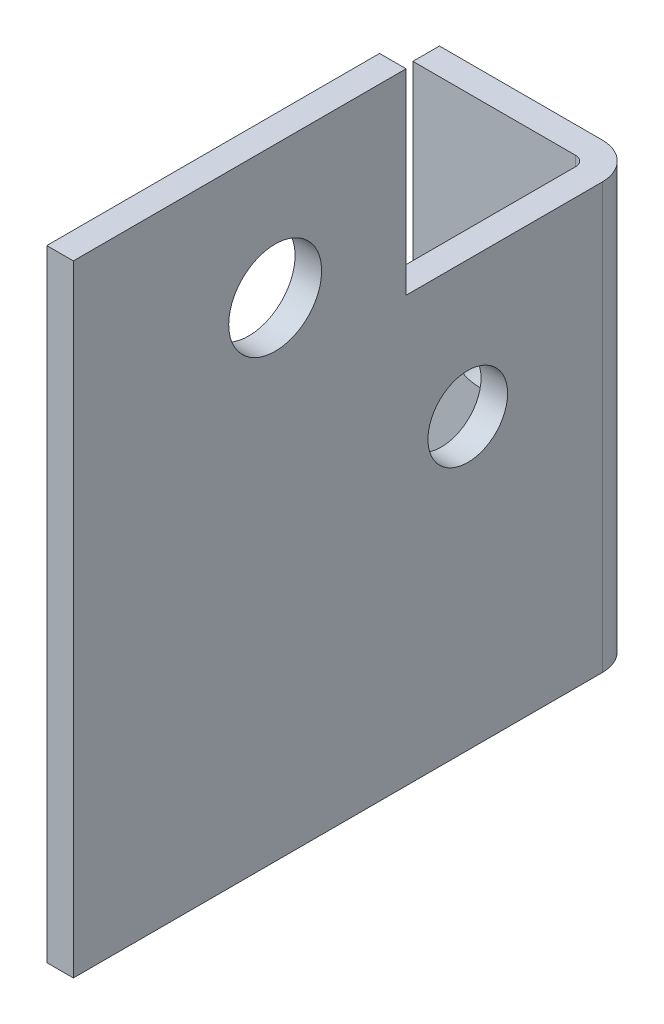
ISO-10303-21;
HEADER;
FILE_DESCRIPTION(('STEP AP214'),'2;1');
FILE_NAME('part.step','',(''),(''),'','','');
FILE_SCHEMA(('AUTOMOTIVE_DESIGN { 1 0 10303 214 1 1 1 1 }'));
ENDSEC;
DATA;
#1=APPLICATION_CONTEXT('core data for automotive mechanical design processes');
#2=APPLICATION_PROTOCOL_DEFINITION('international standard','automotive_design',2000,#1);
#3=PRODUCT_CONTEXT('',#1,'mechanical');
#4=PRODUCT('Part','Part','',(#3));
#5=PRODUCT_RELATED_PRODUCT_CATEGORY('part','',(#4));
#6=PRODUCT_DEFINITION_FORMATION('','',#4);
#7=PRODUCT_DEFINITION_CONTEXT('part definition',#1,'design');
#8=PRODUCT_DEFINITION('design','',#6,#7);
#9=PRODUCT_DEFINITION_SHAPE('','',#8);
#10=(LENGTH_UNIT() NAMED_UNIT(*) SI_UNIT(.MILLI.,.METRE.));
#11=(NAMED_UNIT(*) PLANE_ANGLE_UNIT() SI_UNIT($,.RADIAN.));
#12=(NAMED_UNIT(*) SI_UNIT($,.STERADIAN.) SOLID_ANGLE_UNIT());
#13=UNCERTAINTY_MEASURE_WITH_UNIT(LENGTH_MEASURE(1.E-05),#10,'distance_accuracy_value','');
#14=(GEOMETRIC_REPRESENTATION_CONTEXT(3) GLOBAL_UNCERTAINTY_ASSIGNED_CONTEXT((#13)) GLOBAL_UNIT_ASSIGNED_CONTEXT((#10,
#11,#12)) REPRESENTATION_CONTEXT('',''));
#15=CARTESIAN_POINT('',(0.,0.,0.));
#16=DIRECTION('',(0.,0.,1.));
#17=DIRECTION('',(1.,0.,0.));
#18=AXIS2_PLACEMENT_3D('',#15,#16,#17);
#19=CARTESIAN_POINT('',(2.,0.,35.2));
#20=DIRECTION('',(-1.,0.,0.));
#21=DIRECTION('',(0.,0.,1.));
#22=AXIS2_PLACEMENT_3D('',#19,#20,#21);
#23=PLANE('',#22);
#24=CARTESIAN_POINT('',(2.,25.,5.4966));
#25=DIRECTION('',(1.,0.,0.));
#26=DIRECTION('',(0.,0.,-1.));
#27=AXIS2_PLACEMENT_3D('',#24,#25,#26);
#28=CIRCLE('',#27,3.);
#29=CARTESIAN_POINT('',(2.,25.,2.4966));
#30=VERTEX_POINT('',#29);
#31=EDGE_CURVE('E136',#30,#30,#28,.T.);
#32=ORIENTED_EDGE('',*,*,#31,.F.);
#33=EDGE_LOOP('',(#32));
#34=FACE_BOUND('',#33,.T.);
#35=CARTESIAN_POINT('',(2.,40.,20.));
#36=DIRECTION('',(-1.,0.,0.));
#37=DIRECTION('',(0.,0.,1.));
#38=AXIS2_PLACEMENT_3D('',#35,#36,#37);
#39=CIRCLE('',#38,3.5);
#40=CARTESIAN_POINT('',(2.,40.,23.5));
#41=VERTEX_POINT('',#40);
#42=EDGE_CURVE('E197',#41,#41,#39,.T.);
#43=ORIENTED_EDGE('',*,*,#42,.T.);
#44=EDGE_LOOP('',(#43));
#45=FACE_BOUND('',#44,.T.);
#46=DIRECTION('',(0.,-1.,0.));
#47=VECTOR('',#46,1.);
#48=CARTESIAN_POINT('',(2.,3.23,-4.6334));
#49=LINE('',#48,#47);
#50=CARTESIAN_POINT('',(2.,3.23,-4.6334));
#51=VERTEX_POINT('',#50);
#52=CARTESIAN_POINT('',(2.,35.23,-4.6334));
#53=VERTEX_POINT('',#52);
#54=EDGE_CURVE('E175',#51,#53,#49,.F.);
#55=ORIENTED_EDGE('',*,*,#54,.T.);
#56=DIRECTION('',(0.,0.,1.));
#57=VECTOR('',#56,1.);
#58=CARTESIAN_POINT('',(2.,35.23,15.1));
#59=LINE('',#58,#57);
#60=CARTESIAN_POINT('',(2.,35.23,10.14));
#61=VERTEX_POINT('',#60);
#62=EDGE_CURVE('E146',#53,#61,#59,.T.);
#63=ORIENTED_EDGE('',*,*,#62,.T.);
#64=DIRECTION('',(0.,1.,0.));
#65=VECTOR('',#64,1.);
#66=CARTESIAN_POINT('',(2.,0.,10.14));
#67=LINE('',#66,#65);
#68=CARTESIAN_POINT('',(2.,50.,10.14));
#69=VERTEX_POINT('',#68);
#70=EDGE_CURVE('E190',#61,#69,#67,.T.);
#71=ORIENTED_EDGE('',*,*,#70,.T.);
#72=DIRECTION('',(0.,0.,-1.));
#73=VECTOR('',#72,1.);
#74=CARTESIAN_POINT('',(2.,50.,35.2));
#75=LINE('',#74,#73);
#76=CARTESIAN_POINT('',(2.,50.,35.2));
#77=VERTEX_POINT('',#76);
#78=EDGE_CURVE('E11',#77,#69,#75,.T.);
#79=ORIENTED_EDGE('',*,*,#78,.F.);
#80=DIRECTION('',(0.,1.,0.));
#81=VECTOR('',#80,1.);
#82=CARTESIAN_POINT('',(2.,0.,35.2));
#83=LINE('',#82,#81);
#84=CARTESIAN_POINT('',(2.,3.23,35.2));
#85=VERTEX_POINT('',#84);
#86=EDGE_CURVE('E208',#85,#77,#83,.T.);
#87=ORIENTED_EDGE('',*,*,#86,.F.);
#88=DIRECTION('',(0.,0.,1.));
#89=VECTOR('',#88,1.);
#90=CARTESIAN_POINT('',(2.,3.23,35.2));
#91=LINE('',#90,#89);
#92=EDGE_CURVE('E205',#51,#85,#91,.T.);
#93=ORIENTED_EDGE('',*,*,#92,.F.);
#94=EDGE_LOOP('',(#55,#63,#71,#79,#87,#93));
#95=FACE_BOUND('',#94,.T.);
#96=ADVANCED_FACE('F37',(#34,#45,#95),#23,.F.);
#97=CARTESIAN_POINT('',(0.,0.,35.2));
#98=DIRECTION('',(-1.,0.,0.));
#99=DIRECTION('',(0.,0.,1.));
#100=AXIS2_PLACEMENT_3D('',#97,#98,#99);
#101=PLANE('',#100);
#102=CARTESIAN_POINT('',(0.,25.,5.4966));
#103=DIRECTION('',(1.,0.,0.));
#104=DIRECTION('',(0.,0.,-1.));
#105=AXIS2_PLACEMENT_3D('',#102,#103,#104);
#106=CIRCLE('',#105,3.);
#107=CARTESIAN_POINT('',(0.,25.,2.4966));
#108=VERTEX_POINT('',#107);
#109=EDGE_CURVE('E139',#108,#108,#106,.T.);
#110=ORIENTED_EDGE('',*,*,#109,.T.);
#111=EDGE_LOOP('',(#110));
#112=FACE_BOUND('',#111,.T.);
#113=CARTESIAN_POINT('',(0.,40.,20.));
#114=DIRECTION('',(-1.,0.,0.));
#115=DIRECTION('',(0.,0.,1.));
#116=AXIS2_PLACEMENT_3D('',#113,#114,#115);
#117=CIRCLE('',#116,3.5);
#118=CARTESIAN_POINT('',(0.,40.,23.5));
#119=VERTEX_POINT('',#118);
#120=EDGE_CURVE('E194',#119,#119,#117,.T.);
#121=ORIENTED_EDGE('',*,*,#120,.F.);
#122=EDGE_LOOP('',(#121));
#123=FACE_BOUND('',#122,.T.);
#124=DIRECTION('',(0.,-1.,0.));
#125=VECTOR('',#124,1.);
#126=CARTESIAN_POINT('',(0.,3.23,-4.6334));
#127=LINE('',#126,#125);
#128=CARTESIAN_POINT('',(0.,3.23,-4.6334));
#129=VERTEX_POINT('',#128);
#130=CARTESIAN_POINT('',(0.,35.23,-4.6334));
#131=VERTEX_POINT('',#130);
#132=EDGE_CURVE('E135',#129,#131,#127,.F.);
#133=ORIENTED_EDGE('',*,*,#132,.F.);
#134=DIRECTION('',(0.,0.,-1.));
#135=VECTOR('',#134,1.);
#136=CARTESIAN_POINT('',(0.,3.23,35.2));
#137=LINE('',#136,#135);
#138=CARTESIAN_POINT('',(0.,3.23,35.2));
#139=VERTEX_POINT('',#138);
#140=EDGE_CURVE('E200',#139,#129,#137,.T.);
#141=ORIENTED_EDGE('',*,*,#140,.F.);
#142=DIRECTION('',(0.,1.,0.));
#143=VECTOR('',#142,1.);
#144=CARTESIAN_POINT('',(0.,0.,35.2));
#145=LINE('',#144,#143);
#146=CARTESIAN_POINT('',(0.,50.,35.2));
#147=VERTEX_POINT('',#146);
#148=EDGE_CURVE('E213',#139,#147,#145,.T.);
#149=ORIENTED_EDGE('',*,*,#148,.T.);
#150=DIRECTION('',(0.,0.,-1.));
#151=VECTOR('',#150,1.);
#152=CARTESIAN_POINT('',(0.,50.,35.2));
#153=LINE('',#152,#151);
#154=CARTESIAN_POINT('',(0.,50.,10.14));
#155=VERTEX_POINT('',#154);
#156=EDGE_CURVE('E44',#147,#155,#153,.T.);
#157=ORIENTED_EDGE('',*,*,#156,.T.);
#158=DIRECTION('',(0.,1.,0.));
#159=VECTOR('',#158,1.);
#160=CARTESIAN_POINT('',(0.,35.23,10.14));
#161=LINE('',#160,#159);
#162=CARTESIAN_POINT('',(0.,35.23,10.14));
#163=VERTEX_POINT('',#162);
#164=EDGE_CURVE('E185',#163,#155,#161,.T.);
#165=ORIENTED_EDGE('',*,*,#164,.F.);
#166=DIRECTION('',(0.,0.,-1.));
#167=VECTOR('',#166,1.);
#168=CARTESIAN_POINT('',(0.,35.23,15.1));
#169=LINE('',#168,#167);
#170=EDGE_CURVE('E143',#163,#131,#169,.T.);
#171=ORIENTED_EDGE('',*,*,#170,.T.);
#172=EDGE_LOOP('',(#133,#141,#149,#157,#165,#171));
#173=FACE_BOUND('',#172,.T.);
#174=ADVANCED_FACE('F219',(#112,#123,#173),#101,.T.);
#175=CARTESIAN_POINT('',(0.,3.23,0.));
#176=DIRECTION('',(0.,-1.,0.));
#177=DIRECTION('',(0.,0.,-1.));
#178=AXIS2_PLACEMENT_3D('',#175,#176,#177);
#179=PLANE('',#178);
#180=ORIENTED_EDGE('',*,*,#140,.T.);
#181=DIRECTION('',(1.,0.,0.));
#182=VECTOR('',#181,1.);
#183=CARTESIAN_POINT('',(0.,3.23,-4.6334));
#184=LINE('',#183,#182);
#185=EDGE_CURVE('E178',#129,#51,#184,.T.);
#186=ORIENTED_EDGE('',*,*,#185,.T.);
#187=ORIENTED_EDGE('',*,*,#92,.T.);
#188=DIRECTION('',(-1.,0.,0.));
#189=VECTOR('',#188,1.);
#190=CARTESIAN_POINT('',(0.,3.23,35.2));
#191=LINE('',#190,#189);
#192=EDGE_CURVE('E203',#85,#139,#191,.T.);
#193=ORIENTED_EDGE('',*,*,#192,.T.);
#194=EDGE_LOOP('',(#180,#186,#187,#193));
#195=FACE_BOUND('',#194,.T.);
#196=ADVANCED_FACE('F228',(#195),#179,.T.);
#197=CARTESIAN_POINT('',(0.,0.,35.2));
#198=DIRECTION('',(0.,0.,-1.));
#199=DIRECTION('',(-1.,0.,0.));
#200=AXIS2_PLACEMENT_3D('',#197,#198,#199);
#201=PLANE('',#200);
#202=ORIENTED_EDGE('',*,*,#192,.F.);
#203=ORIENTED_EDGE('',*,*,#86,.T.);
#204=DIRECTION('',(1.,0.,0.));
#205=VECTOR('',#204,1.);
#206=CARTESIAN_POINT('',(0.,50.,35.2));
#207=LINE('',#206,#205);
#208=EDGE_CURVE('E211',#147,#77,#207,.T.);
#209=ORIENTED_EDGE('',*,*,#208,.F.);
#210=ORIENTED_EDGE('',*,*,#148,.F.);
#211=EDGE_LOOP('',(#202,#203,#209,#210));
#212=FACE_BOUND('',#211,.T.);
#213=ADVANCED_FACE('F232',(#212),#201,.F.);
#214=CARTESIAN_POINT('',(0.,50.,35.2));
#215=DIRECTION('',(0.,1.,0.));
#216=DIRECTION('',(0.,0.,1.));
#217=AXIS2_PLACEMENT_3D('',#214,#215,#216);
#218=PLANE('',#217);
#219=DIRECTION('',(-1.,0.,0.));
#220=VECTOR('',#219,1.);
#221=CARTESIAN_POINT('',(8.,50.,10.14));
#222=LINE('',#221,#220);
#223=EDGE_CURVE('E188',#69,#155,#222,.T.);
#224=ORIENTED_EDGE('',*,*,#223,.T.);
#225=ORIENTED_EDGE('',*,*,#156,.F.);
#226=ORIENTED_EDGE('',*,*,#208,.T.);
#227=ORIENTED_EDGE('',*,*,#78,.T.);
#228=EDGE_LOOP('',(#224,#225,#226,#227));
#229=FACE_BOUND('',#228,.T.);
#230=ADVANCED_FACE('F223',(#229),#218,.T.);
#231=CARTESIAN_POINT('',(10.,40.,20.));
#232=DIRECTION('',(-1.,0.,0.));
#233=DIRECTION('',(0.,0.,1.));
#234=AXIS2_PLACEMENT_3D('',#231,#232,#233);
#235=CYLINDRICAL_SURFACE('',#234,3.5);
#236=ORIENTED_EDGE('',*,*,#120,.T.);
#237=EDGE_LOOP('',(#236));
#238=FACE_BOUND('',#237,.T.);
#239=ORIENTED_EDGE('',*,*,#42,.F.);
#240=EDGE_LOOP('',(#239));
#241=FACE_BOUND('',#240,.T.);
#242=ADVANCED_FACE('F272',(#238,#241),#235,.F.);
#243=CARTESIAN_POINT('',(8.,35.23,10.14));
#244=DIRECTION('',(0.,0.,1.));
#245=DIRECTION('',(1.,0.,0.));
#246=AXIS2_PLACEMENT_3D('',#243,#244,#245);
#247=PLANE('',#246);
#248=DIRECTION('',(-1.,0.,0.));
#249=VECTOR('',#248,1.);
#250=CARTESIAN_POINT('',(8.,35.23,10.14));
#251=LINE('',#250,#249);
#252=EDGE_CURVE('E59',#61,#163,#251,.T.);
#253=ORIENTED_EDGE('',*,*,#252,.T.);
#254=ORIENTED_EDGE('',*,*,#164,.T.);
#255=ORIENTED_EDGE('',*,*,#223,.F.);
#256=ORIENTED_EDGE('',*,*,#70,.F.);
#257=EDGE_LOOP('',(#253,#254,#255,#256));
#258=FACE_BOUND('',#257,.T.);
#259=ADVANCED_FACE('F226',(#258),#247,.F.);
#260=CARTESIAN_POINT('',(-0.736599999999997,3.23,-4.6334));
#261=DIRECTION('',(0.,1.,0.));
#262=DIRECTION('',(0.,0.,1.));
#263=AXIS2_PLACEMENT_3D('',#260,#261,#262);
#264=PLANE('',#263);
#265=CARTESIAN_POINT('',(-0.736599999999997,3.23,-4.6334));
#266=DIRECTION('',(0.,-1.,0.));
#267=DIRECTION('',(0.,0.,-1.));
#268=AXIS2_PLACEMENT_3D('',#265,#266,#267);
#269=CIRCLE('',#268,0.7366);
#270=CARTESIAN_POINT('',(-0.736599999999994,3.23,-5.37));
#271=VERTEX_POINT('',#270);
#272=EDGE_CURVE('E51',#271,#129,#269,.T.);
#273=ORIENTED_EDGE('',*,*,#272,.F.);
#274=DIRECTION('',(0.,0.,-1.));
#275=VECTOR('',#274,1.);
#276=CARTESIAN_POINT('',(-0.736599999999997,3.23,-5.37));
#277=LINE('',#276,#275);
#278=CARTESIAN_POINT('',(-0.736599999999997,3.23,-7.37));
#279=VERTEX_POINT('',#278);
#280=EDGE_CURVE('E130',#271,#279,#277,.T.);
#281=ORIENTED_EDGE('',*,*,#280,.T.);
#282=CARTESIAN_POINT('',(-0.736599999999997,3.23,-4.6334));
#283=DIRECTION('',(0.,-1.,0.));
#284=DIRECTION('',(0.,0.,-1.));
#285=AXIS2_PLACEMENT_3D('',#282,#283,#284);
#286=CIRCLE('',#285,2.7366);
#287=EDGE_CURVE('E179',#279,#51,#286,.T.);
#288=ORIENTED_EDGE('',*,*,#287,.T.);
#289=ORIENTED_EDGE('',*,*,#185,.F.);
#290=EDGE_LOOP('',(#273,#281,#288,#289));
#291=FACE_BOUND('',#290,.T.);
#292=ADVANCED_FACE('F280',(#291),#264,.F.);
#293=CARTESIAN_POINT('',(-0.736599999999997,3.23,-4.6334));
#294=DIRECTION('',(0.,-1.,0.));
#295=DIRECTION('',(0.,0.,-1.));
#296=AXIS2_PLACEMENT_3D('',#293,#294,#295);
#297=CYLINDRICAL_SURFACE('',#296,2.7366);
#298=ORIENTED_EDGE('',*,*,#54,.F.);
#299=ORIENTED_EDGE('',*,*,#287,.F.);
#300=DIRECTION('',(0.,-1.,0.));
#301=VECTOR('',#300,1.);
#302=CARTESIAN_POINT('',(-0.736599999999997,0.,-7.37));
#303=LINE('',#302,#301);
#304=CARTESIAN_POINT('',(-0.736599999999997,35.23,-7.37));
#305=VERTEX_POINT('',#304);
#306=EDGE_CURVE('E170',#305,#279,#303,.T.);
#307=ORIENTED_EDGE('',*,*,#306,.F.);
#308=CARTESIAN_POINT('',(-0.736599999999997,35.23,-4.6334));
#309=DIRECTION('',(0.,-1.,0.));
#310=DIRECTION('',(0.,0.,-1.));
#311=AXIS2_PLACEMENT_3D('',#308,#309,#310);
#312=CIRCLE('',#311,2.7366);
#313=EDGE_CURVE('E149',#305,#53,#312,.T.);
#314=ORIENTED_EDGE('',*,*,#313,.T.);
#315=EDGE_LOOP('',(#298,#299,#307,#314));
#316=FACE_BOUND('',#315,.T.);
#317=ADVANCED_FACE('F242',(#316),#297,.T.);
#318=CARTESIAN_POINT('',(-0.736599999999997,3.23,-4.6334));
#319=DIRECTION('',(0.,-1.,0.));
#320=DIRECTION('',(0.,0.,-1.));
#321=AXIS2_PLACEMENT_3D('',#318,#319,#320);
#322=CYLINDRICAL_SURFACE('',#321,0.7366);
#323=ORIENTED_EDGE('',*,*,#132,.T.);
#324=CARTESIAN_POINT('',(-0.736599999999997,35.23,-4.6334));
#325=DIRECTION('',(0.,-1.,0.));
#326=DIRECTION('',(0.,0.,-1.));
#327=AXIS2_PLACEMENT_3D('',#324,#325,#326);
#328=CIRCLE('',#327,0.73660000000002);
#329=CARTESIAN_POINT('',(-0.736599999999997,35.23,-5.37000000000004));
#330=VERTEX_POINT('',#329);
#331=EDGE_CURVE('E118',#131,#330,#328,.F.);
#332=ORIENTED_EDGE('',*,*,#331,.T.);
#333=DIRECTION('',(0.,1.,0.));
#334=VECTOR('',#333,1.);
#335=CARTESIAN_POINT('',(-0.736599999999997,23.23,-5.37));
#336=LINE('',#335,#334);
#337=EDGE_CURVE('E125',#330,#271,#336,.F.);
#338=ORIENTED_EDGE('',*,*,#337,.T.);
#339=ORIENTED_EDGE('',*,*,#272,.T.);
#340=EDGE_LOOP('',(#323,#332,#338,#339));
#341=FACE_BOUND('',#340,.T.);
#342=ADVANCED_FACE('F133',(#341),#322,.F.);
#343=CARTESIAN_POINT('',(0.,3.23,-7.37));
#344=DIRECTION('',(0.,-1.,0.));
#345=DIRECTION('',(0.,0.,-1.));
#346=AXIS2_PLACEMENT_3D('',#343,#344,#345);
#347=PLANE('',#346);
#348=DIRECTION('',(1.,0.,0.));
#349=VECTOR('',#348,1.);
#350=CARTESIAN_POINT('',(0.,3.23,-7.37));
#351=LINE('',#350,#349);
#352=CARTESIAN_POINT('',(-13.,3.23,-7.37000000000004));
#353=VERTEX_POINT('',#352);
#354=EDGE_CURVE('E163',#353,#279,#351,.T.);
#355=ORIENTED_EDGE('',*,*,#354,.T.);
#356=ORIENTED_EDGE('',*,*,#280,.F.);
#357=DIRECTION('',(-1.,0.,0.));
#358=VECTOR('',#357,1.);
#359=CARTESIAN_POINT('',(0.,3.23,-5.37));
#360=LINE('',#359,#358);
#361=CARTESIAN_POINT('',(-13.,3.23,-5.37000000000004));
#362=VERTEX_POINT('',#361);
#363=EDGE_CURVE('E128',#362,#271,#360,.F.);
#364=ORIENTED_EDGE('',*,*,#363,.F.);
#365=DIRECTION('',(0.,0.,1.));
#366=VECTOR('',#365,1.);
#367=CARTESIAN_POINT('',(-13.,3.23,-7.37000000000004));
#368=LINE('',#367,#366);
#369=EDGE_CURVE('E160',#353,#362,#368,.T.);
#370=ORIENTED_EDGE('',*,*,#369,.F.);
#371=EDGE_LOOP('',(#355,#356,#364,#370));
#372=FACE_BOUND('',#371,.T.);
#373=ADVANCED_FACE('F336',(#372),#347,.T.);
#374=CARTESIAN_POINT('',(0.,0.,-7.37));
#375=DIRECTION('',(0.,0.,-1.));
#376=DIRECTION('',(-1.,0.,0.));
#377=AXIS2_PLACEMENT_3D('',#374,#375,#376);
#378=PLANE('',#377);
#379=CARTESIAN_POINT('',(-8.00000000000001,7.23,-7.37000000000003));
#380=DIRECTION('',(0.,0.,-1.));
#381=DIRECTION('',(-1.,0.,0.));
#382=AXIS2_PLACEMENT_3D('',#379,#380,#381);
#383=CIRCLE('',#382,2.75);
#384=CARTESIAN_POINT('',(-10.75,7.23,-7.37000000000004));
#385=VERTEX_POINT('',#384);
#386=EDGE_CURVE('E152',#385,#385,#383,.T.);
#387=ORIENTED_EDGE('',*,*,#386,.F.);
#388=EDGE_LOOP('',(#387));
#389=FACE_BOUND('',#388,.T.);
#390=CARTESIAN_POINT('',(-8.00000000000001,19.23,-7.37000000000003));
#391=DIRECTION('',(0.,0.,-1.));
#392=DIRECTION('',(-1.,0.,0.));
#393=AXIS2_PLACEMENT_3D('',#390,#391,#392);
#394=CIRCLE('',#393,2.75);
#395=CARTESIAN_POINT('',(-10.75,19.23,-7.37000000000004));
#396=VERTEX_POINT('',#395);
#397=EDGE_CURVE('E131',#396,#396,#394,.T.);
#398=ORIENTED_EDGE('',*,*,#397,.F.);
#399=EDGE_LOOP('',(#398));
#400=FACE_BOUND('',#399,.T.);
#401=ORIENTED_EDGE('',*,*,#306,.T.);
#402=ORIENTED_EDGE('',*,*,#354,.F.);
#403=DIRECTION('',(0.,-1.,0.));
#404=VECTOR('',#403,1.);
#405=CARTESIAN_POINT('',(-13.,3.23,-7.37000000000004));
#406=LINE('',#405,#404);
#407=CARTESIAN_POINT('',(-13.,35.23,-7.37));
#408=VERTEX_POINT('',#407);
#409=EDGE_CURVE('E165',#408,#353,#406,.T.);
#410=ORIENTED_EDGE('',*,*,#409,.F.);
#411=DIRECTION('',(1.,0.,0.));
#412=VECTOR('',#411,1.);
#413=CARTESIAN_POINT('',(-13.,35.23,-7.37));
#414=LINE('',#413,#412);
#415=EDGE_CURVE('E237',#408,#305,#414,.T.);
#416=ORIENTED_EDGE('',*,*,#415,.T.);
#417=EDGE_LOOP('',(#401,#402,#410,#416));
#418=FACE_BOUND('',#417,.T.);
#419=ADVANCED_FACE('F245',(#389,#400,#418),#378,.T.);
#420=CARTESIAN_POINT('',(0.,0.,-5.37));
#421=DIRECTION('',(0.,0.,-1.));
#422=DIRECTION('',(-1.,0.,0.));
#423=AXIS2_PLACEMENT_3D('',#420,#421,#422);
#424=PLANE('',#423);
#425=CARTESIAN_POINT('',(-8.00000000000001,7.23,-5.37));
#426=DIRECTION('',(0.,0.,1.));
#427=DIRECTION('',(1.,0.,0.));
#428=AXIS2_PLACEMENT_3D('',#425,#426,#427);
#429=CIRCLE('',#428,2.75);
#430=CARTESIAN_POINT('',(-5.25000000000001,7.23,-5.37));
#431=VERTEX_POINT('',#430);
#432=EDGE_CURVE('E145',#431,#431,#429,.T.);
#433=ORIENTED_EDGE('',*,*,#432,.F.);
#434=EDGE_LOOP('',(#433));
#435=FACE_BOUND('',#434,.T.);
#436=CARTESIAN_POINT('',(-8.00000000000001,19.23,-5.37));
#437=DIRECTION('',(0.,0.,1.));
#438=DIRECTION('',(1.,0.,0.));
#439=AXIS2_PLACEMENT_3D('',#436,#437,#438);
#440=CIRCLE('',#439,2.75);
#441=CARTESIAN_POINT('',(-5.25000000000001,19.23,-5.37));
#442=VERTEX_POINT('',#441);
#443=EDGE_CURVE('E155',#442,#442,#440,.T.);
#444=ORIENTED_EDGE('',*,*,#443,.F.);
#445=EDGE_LOOP('',(#444));
#446=FACE_BOUND('',#445,.T.);
#447=ORIENTED_EDGE('',*,*,#337,.F.);
#448=DIRECTION('',(-1.,0.,0.));
#449=VECTOR('',#448,1.);
#450=CARTESIAN_POINT('',(-13.,35.23,-5.37000000000004));
#451=LINE('',#450,#449);
#452=CARTESIAN_POINT('',(-13.,35.23,-5.37000000000004));
#453=VERTEX_POINT('',#452);
#454=EDGE_CURVE('E114',#330,#453,#451,.T.);
#455=ORIENTED_EDGE('',*,*,#454,.T.);
#456=DIRECTION('',(0.,1.,0.));
#457=VECTOR('',#456,1.);
#458=CARTESIAN_POINT('',(-13.,0.,-5.37000000000004));
#459=LINE('',#458,#457);
#460=EDGE_CURVE('E168',#453,#362,#459,.F.);
#461=ORIENTED_EDGE('',*,*,#460,.T.);
#462=ORIENTED_EDGE('',*,*,#363,.T.);
#463=EDGE_LOOP('',(#447,#455,#461,#462));
#464=FACE_BOUND('',#463,.T.);
#465=ADVANCED_FACE('F126',(#435,#446,#464),#424,.F.);
#466=CARTESIAN_POINT('',(-13.,3.23,-7.37000000000004));
#467=DIRECTION('',(-1.,0.,0.));
#468=DIRECTION('',(0.,0.,1.));
#469=AXIS2_PLACEMENT_3D('',#466,#467,#468);
#470=PLANE('',#469);
#471=ORIENTED_EDGE('',*,*,#460,.F.);
#472=DIRECTION('',(0.,0.,-1.));
#473=VECTOR('',#472,1.);
#474=CARTESIAN_POINT('',(-13.,35.23,-5.37000000000004));
#475=LINE('',#474,#473);
#476=EDGE_CURVE('E121',#453,#408,#475,.T.);
#477=ORIENTED_EDGE('',*,*,#476,.T.);
#478=ORIENTED_EDGE('',*,*,#409,.T.);
#479=ORIENTED_EDGE('',*,*,#369,.T.);
#480=EDGE_LOOP('',(#471,#477,#478,#479));
#481=FACE_BOUND('',#480,.T.);
#482=ADVANCED_FACE('F366',(#481),#470,.T.);
#483=CARTESIAN_POINT('',(-8.00000000000001,19.23,-14.88));
#484=DIRECTION('',(0.,0.,1.));
#485=DIRECTION('',(1.,0.,0.));
#486=AXIS2_PLACEMENT_3D('',#483,#484,#485);
#487=CYLINDRICAL_SURFACE('',#486,2.75);
#488=ORIENTED_EDGE('',*,*,#397,.T.);
#489=EDGE_LOOP('',(#488));
#490=FACE_BOUND('',#489,.T.);
#491=ORIENTED_EDGE('',*,*,#443,.T.);
#492=EDGE_LOOP('',(#491));
#493=FACE_BOUND('',#492,.T.);
#494=ADVANCED_FACE('F377',(#490,#493),#487,.F.);
#495=CARTESIAN_POINT('',(-8.00000000000001,7.23,-14.88));
#496=DIRECTION('',(0.,0.,1.));
#497=DIRECTION('',(1.,0.,0.));
#498=AXIS2_PLACEMENT_3D('',#495,#496,#497);
#499=CYLINDRICAL_SURFACE('',#498,2.75);
#500=ORIENTED_EDGE('',*,*,#386,.T.);
#501=EDGE_LOOP('',(#500));
#502=FACE_BOUND('',#501,.T.);
#503=ORIENTED_EDGE('',*,*,#432,.T.);
#504=EDGE_LOOP('',(#503));
#505=FACE_BOUND('',#504,.T.);
#506=ADVANCED_FACE('F260',(#502,#505),#499,.F.);
#507=CARTESIAN_POINT('',(10.,35.23,15.1));
#508=DIRECTION('',(0.,1.,0.));
#509=DIRECTION('',(0.,0.,1.));
#510=AXIS2_PLACEMENT_3D('',#507,#508,#509);
#511=PLANE('',#510);
#512=ORIENTED_EDGE('',*,*,#252,.F.);
#513=ORIENTED_EDGE('',*,*,#62,.F.);
#514=ORIENTED_EDGE('',*,*,#313,.F.);
#515=ORIENTED_EDGE('',*,*,#415,.F.);
#516=ORIENTED_EDGE('',*,*,#476,.F.);
#517=ORIENTED_EDGE('',*,*,#454,.F.);
#518=ORIENTED_EDGE('',*,*,#331,.F.);
#519=ORIENTED_EDGE('',*,*,#170,.F.);
#520=EDGE_LOOP('',(#512,#513,#514,#515,#516,#517,#518,#519));
#521=FACE_BOUND('',#520,.T.);
#522=ADVANCED_FACE('F116',(#521),#511,.T.);
#523=CARTESIAN_POINT('',(2.,25.,5.4966));
#524=DIRECTION('',(-1.,0.,0.));
#525=DIRECTION('',(0.,0.,-1.));
#526=AXIS2_PLACEMENT_3D('',#523,#524,#525);
#527=CYLINDRICAL_SURFACE('',#526,3.);
#528=ORIENTED_EDGE('',*,*,#31,.T.);
#529=EDGE_LOOP('',(#528));
#530=FACE_BOUND('',#529,.T.);
#531=ORIENTED_EDGE('',*,*,#109,.F.);
#532=EDGE_LOOP('',(#531));
#533=FACE_BOUND('',#532,.T.);
#534=ADVANCED_FACE('F253',(#530,#533),#527,.F.);
#535=CLOSED_SHELL('',(#96,#174,#196,#213,#230,#242,#259,#292,#317,#342,#373,#419,#465,#482,#494,
#506,#522,#534));
#536=MANIFOLD_SOLID_BREP('B2',#535);
#537=ADVANCED_BREP_SHAPE_REPRESENTATION('',(#18,#536),#14);
#538=SHAPE_DEFINITION_REPRESENTATION(#9,#537);
ENDSEC;
END-ISO-10303-21;
